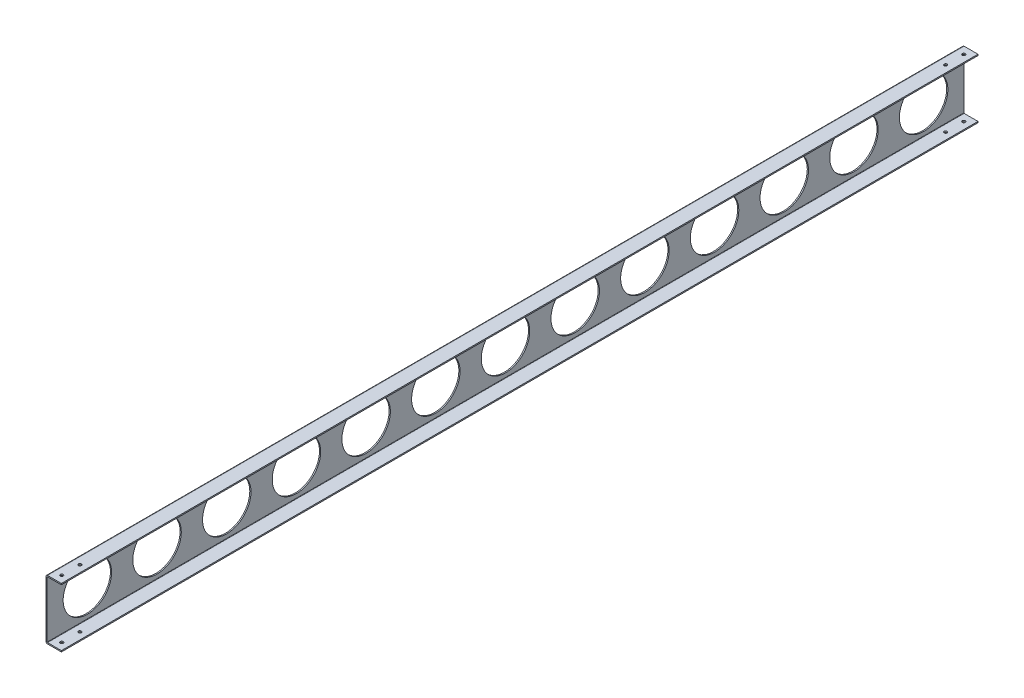
ISO-10303-21;
HEADER;
FILE_DESCRIPTION(('STEP AP214'),'2;1');
FILE_NAME('part.step','',(''),(''),'','','');
FILE_SCHEMA(('AUTOMOTIVE_DESIGN { 1 0 10303 214 1 1 1 1 }'));
ENDSEC;
DATA;
#1=APPLICATION_CONTEXT('core data for automotive mechanical design processes');
#2=APPLICATION_PROTOCOL_DEFINITION('international standard','automotive_design',2000,#1);
#3=PRODUCT_CONTEXT('',#1,'mechanical');
#4=PRODUCT('Part','Part','',(#3));
#5=PRODUCT_RELATED_PRODUCT_CATEGORY('part','',(#4));
#6=PRODUCT_DEFINITION_FORMATION('','',#4);
#7=PRODUCT_DEFINITION_CONTEXT('part definition',#1,'design');
#8=PRODUCT_DEFINITION('design','',#6,#7);
#9=PRODUCT_DEFINITION_SHAPE('','',#8);
#10=(LENGTH_UNIT() NAMED_UNIT(*) SI_UNIT(.MILLI.,.METRE.));
#11=(NAMED_UNIT(*) PLANE_ANGLE_UNIT() SI_UNIT($,.RADIAN.));
#12=(NAMED_UNIT(*) SI_UNIT($,.STERADIAN.) SOLID_ANGLE_UNIT());
#13=UNCERTAINTY_MEASURE_WITH_UNIT(LENGTH_MEASURE(1.E-05),#10,'distance_accuracy_value','');
#14=(GEOMETRIC_REPRESENTATION_CONTEXT(3) GLOBAL_UNCERTAINTY_ASSIGNED_CONTEXT((#13)) GLOBAL_UNIT_ASSIGNED_CONTEXT((#10,
#11,#12)) REPRESENTATION_CONTEXT('',''));
#15=CARTESIAN_POINT('',(0.,0.,0.));
#16=DIRECTION('',(0.,0.,1.));
#17=DIRECTION('',(1.,0.,0.));
#18=AXIS2_PLACEMENT_3D('',#15,#16,#17);
#19=CARTESIAN_POINT('',(2.54000000000001,-49.,756.30962295));
#20=DIRECTION('',(0.,1.,0.));
#21=DIRECTION('',(-1.,0.,0.));
#22=AXIS2_PLACEMENT_3D('',#19,#20,#21);
#23=PLANE('',#22);
#24=CARTESIAN_POINT('',(13.97,-49.,-744.30962295));
#25=DIRECTION('',(0.,-1.,0.));
#26=DIRECTION('',(0.,0.,-1.));
#27=AXIS2_PLACEMENT_3D('',#24,#25,#26);
#28=CIRCLE('',#27,2.48919999999999);
#29=CARTESIAN_POINT('',(13.97,-49.,-746.79882295));
#30=VERTEX_POINT('',#29);
#31=EDGE_CURVE('E466',#30,#30,#28,.T.);
#32=ORIENTED_EDGE('',*,*,#31,.F.);
#33=EDGE_LOOP('',(#32));
#34=FACE_BOUND('',#33,.T.);
#35=CARTESIAN_POINT('',(13.97,-49.,-714.30962295));
#36=DIRECTION('',(0.,-1.,0.));
#37=DIRECTION('',(0.,0.,-1.));
#38=AXIS2_PLACEMENT_3D('',#35,#36,#37);
#39=CIRCLE('',#38,2.48919999999999);
#40=CARTESIAN_POINT('',(13.97,-49.,-716.79882295));
#41=VERTEX_POINT('',#40);
#42=EDGE_CURVE('E456',#41,#41,#39,.T.);
#43=ORIENTED_EDGE('',*,*,#42,.F.);
#44=EDGE_LOOP('',(#43));
#45=FACE_BOUND('',#44,.T.);
#46=CARTESIAN_POINT('',(13.97,-49.,744.30962295));
#47=DIRECTION('',(0.,-1.,0.));
#48=DIRECTION('',(0.,0.,-1.));
#49=AXIS2_PLACEMENT_3D('',#46,#47,#48);
#50=CIRCLE('',#49,2.48919999999999);
#51=CARTESIAN_POINT('',(13.97,-49.,741.82042295));
#52=VERTEX_POINT('',#51);
#53=EDGE_CURVE('E446',#52,#52,#50,.T.);
#54=ORIENTED_EDGE('',*,*,#53,.F.);
#55=EDGE_LOOP('',(#54));
#56=FACE_BOUND('',#55,.T.);
#57=CARTESIAN_POINT('',(13.97,-49.,714.30962295));
#58=DIRECTION('',(0.,-1.,0.));
#59=DIRECTION('',(0.,0.,-1.));
#60=AXIS2_PLACEMENT_3D('',#57,#58,#59);
#61=CIRCLE('',#60,2.48919999999999);
#62=CARTESIAN_POINT('',(13.97,-49.,711.82042295));
#63=VERTEX_POINT('',#62);
#64=EDGE_CURVE('E436',#63,#63,#61,.T.);
#65=ORIENTED_EDGE('',*,*,#64,.F.);
#66=EDGE_LOOP('',(#65));
#67=FACE_BOUND('',#66,.T.);
#68=DIRECTION('',(1.,0.,0.));
#69=VECTOR('',#68,1.);
#70=CARTESIAN_POINT('',(2.54000000000001,-49.,-756.30962295));
#71=LINE('',#70,#69);
#72=CARTESIAN_POINT('',(2.54000000000001,-49.,-756.30962295));
#73=VERTEX_POINT('',#72);
#74=CARTESIAN_POINT('',(25.4,-49.,-756.30962295));
#75=VERTEX_POINT('',#74);
#76=EDGE_CURVE('E155',#73,#75,#71,.T.);
#77=ORIENTED_EDGE('',*,*,#76,.T.);
#78=DIRECTION('',(0.,0.,-1.));
#79=VECTOR('',#78,1.);
#80=CARTESIAN_POINT('',(25.4,-49.,756.30962295));
#81=LINE('',#80,#79);
#82=CARTESIAN_POINT('',(25.4,-49.,756.30962295));
#83=VERTEX_POINT('',#82);
#84=EDGE_CURVE('E202',#83,#75,#81,.T.);
#85=ORIENTED_EDGE('',*,*,#84,.F.);
#86=DIRECTION('',(1.,0.,0.));
#87=VECTOR('',#86,1.);
#88=CARTESIAN_POINT('',(2.54000000000001,-49.,756.30962295));
#89=LINE('',#88,#87);
#90=CARTESIAN_POINT('',(2.54000000000001,-49.,756.30962295));
#91=VERTEX_POINT('',#90);
#92=EDGE_CURVE('E102',#91,#83,#89,.T.);
#93=ORIENTED_EDGE('',*,*,#92,.F.);
#94=DIRECTION('',(0.,0.,-1.));
#95=VECTOR('',#94,1.);
#96=CARTESIAN_POINT('',(2.54000000000001,-49.,756.30962295));
#97=LINE('',#96,#95);
#98=EDGE_CURVE('E151',#91,#73,#97,.T.);
#99=ORIENTED_EDGE('',*,*,#98,.T.);
#100=EDGE_LOOP('',(#77,#85,#93,#99));
#101=FACE_BOUND('',#100,.T.);
#102=ADVANCED_FACE('F32',(#34,#45,#56,#67,#101),#23,.F.);
#103=CARTESIAN_POINT('',(25.4,-47.,756.30962295));
#104=DIRECTION('',(1.,0.,0.));
#105=DIRECTION('',(0.,0.,-1.));
#106=AXIS2_PLACEMENT_3D('',#103,#104,#105);
#107=PLANE('',#106);
#108=DIRECTION('',(0.,-1.,0.));
#109=VECTOR('',#108,1.);
#110=CARTESIAN_POINT('',(25.4,-47.,-756.30962295));
#111=LINE('',#110,#109);
#112=CARTESIAN_POINT('',(25.4,-47.,-756.30962295));
#113=VERTEX_POINT('',#112);
#114=EDGE_CURVE('E158',#113,#75,#111,.T.);
#115=ORIENTED_EDGE('',*,*,#114,.F.);
#116=DIRECTION('',(0.,0.,-1.));
#117=VECTOR('',#116,1.);
#118=CARTESIAN_POINT('',(25.4,-47.,756.30962295));
#119=LINE('',#118,#117);
#120=CARTESIAN_POINT('',(25.4,-47.,756.30962295));
#121=VERTEX_POINT('',#120);
#122=EDGE_CURVE('E200',#121,#113,#119,.T.);
#123=ORIENTED_EDGE('',*,*,#122,.F.);
#124=DIRECTION('',(0.,-1.,0.));
#125=VECTOR('',#124,1.);
#126=CARTESIAN_POINT('',(25.4,-47.,756.30962295));
#127=LINE('',#126,#125);
#128=EDGE_CURVE('E409',#121,#83,#127,.T.);
#129=ORIENTED_EDGE('',*,*,#128,.T.);
#130=ORIENTED_EDGE('',*,*,#84,.T.);
#131=EDGE_LOOP('',(#115,#123,#129,#130));
#132=FACE_BOUND('',#131,.T.);
#133=ADVANCED_FACE('F286',(#132),#107,.T.);
#134=CARTESIAN_POINT('',(2.54000000000001,-47.,756.30962295));
#135=DIRECTION('',(0.,1.,0.));
#136=DIRECTION('',(-1.,0.,0.));
#137=AXIS2_PLACEMENT_3D('',#134,#135,#136);
#138=PLANE('',#137);
#139=CARTESIAN_POINT('',(13.97,-47.,-744.30962295));
#140=DIRECTION('',(0.,1.,0.));
#141=DIRECTION('',(-1.,0.,0.));
#142=AXIS2_PLACEMENT_3D('',#139,#140,#141);
#143=CIRCLE('',#142,2.48919999999998);
#144=CARTESIAN_POINT('',(11.4808000000001,-47.,-744.30962295));
#145=VERTEX_POINT('',#144);
#146=EDGE_CURVE('E459',#145,#145,#143,.T.);
#147=ORIENTED_EDGE('',*,*,#146,.F.);
#148=EDGE_LOOP('',(#147));
#149=FACE_BOUND('',#148,.T.);
#150=CARTESIAN_POINT('',(13.97,-47.,-714.30962295));
#151=DIRECTION('',(0.,1.,0.));
#152=DIRECTION('',(-1.,0.,0.));
#153=AXIS2_PLACEMENT_3D('',#150,#151,#152);
#154=CIRCLE('',#153,2.48919999999998);
#155=CARTESIAN_POINT('',(11.4808,-47.,-714.30962295));
#156=VERTEX_POINT('',#155);
#157=EDGE_CURVE('E449',#156,#156,#154,.T.);
#158=ORIENTED_EDGE('',*,*,#157,.F.);
#159=EDGE_LOOP('',(#158));
#160=FACE_BOUND('',#159,.T.);
#161=CARTESIAN_POINT('',(13.97,-47.,744.30962295));
#162=DIRECTION('',(0.,1.,0.));
#163=DIRECTION('',(-1.,0.,0.));
#164=AXIS2_PLACEMENT_3D('',#161,#162,#163);
#165=CIRCLE('',#164,2.48919999999998);
#166=CARTESIAN_POINT('',(11.4808000000001,-47.,744.30962295));
#167=VERTEX_POINT('',#166);
#168=EDGE_CURVE('E439',#167,#167,#165,.T.);
#169=ORIENTED_EDGE('',*,*,#168,.F.);
#170=EDGE_LOOP('',(#169));
#171=FACE_BOUND('',#170,.T.);
#172=CARTESIAN_POINT('',(13.97,-47.,714.30962295));
#173=DIRECTION('',(0.,1.,0.));
#174=DIRECTION('',(-1.,0.,0.));
#175=AXIS2_PLACEMENT_3D('',#172,#173,#174);
#176=CIRCLE('',#175,2.48919999999998);
#177=CARTESIAN_POINT('',(11.4808,-47.,714.30962295));
#178=VERTEX_POINT('',#177);
#179=EDGE_CURVE('E430',#178,#178,#176,.T.);
#180=ORIENTED_EDGE('',*,*,#179,.F.);
#181=EDGE_LOOP('',(#180));
#182=FACE_BOUND('',#181,.T.);
#183=DIRECTION('',(1.,0.,0.));
#184=VECTOR('',#183,1.);
#185=CARTESIAN_POINT('',(2.54000000000001,-47.,-756.30962295));
#186=LINE('',#185,#184);
#187=CARTESIAN_POINT('',(2.54000000000001,-47.,-756.30962295));
#188=VERTEX_POINT('',#187);
#189=EDGE_CURVE('E162',#188,#113,#186,.T.);
#190=ORIENTED_EDGE('',*,*,#189,.F.);
#191=DIRECTION('',(0.,0.,-1.));
#192=VECTOR('',#191,1.);
#193=CARTESIAN_POINT('',(2.54000000000001,-47.,756.30962295));
#194=LINE('',#193,#192);
#195=CARTESIAN_POINT('',(2.54000000000001,-47.,756.30962295));
#196=VERTEX_POINT('',#195);
#197=EDGE_CURVE('E198',#196,#188,#194,.T.);
#198=ORIENTED_EDGE('',*,*,#197,.F.);
#199=DIRECTION('',(1.,0.,0.));
#200=VECTOR('',#199,1.);
#201=CARTESIAN_POINT('',(2.54000000000001,-47.,756.30962295));
#202=LINE('',#201,#200);
#203=EDGE_CURVE('E406',#196,#121,#202,.T.);
#204=ORIENTED_EDGE('',*,*,#203,.T.);
#205=ORIENTED_EDGE('',*,*,#122,.T.);
#206=EDGE_LOOP('',(#190,#198,#204,#205));
#207=FACE_BOUND('',#206,.T.);
#208=ADVANCED_FACE('F280',(#149,#160,#171,#182,#207),#138,.T.);
#209=CARTESIAN_POINT('',(2.54000000000001,-46.46,756.30962295));
#210=DIRECTION('',(0.,0.,-1.));
#211=DIRECTION('',(-1.,0.,0.));
#212=AXIS2_PLACEMENT_3D('',#209,#210,#211);
#213=CYLINDRICAL_SURFACE('',#212,0.540000000000001);
#214=CARTESIAN_POINT('',(2.54000000000001,-46.46,-756.30962295));
#215=DIRECTION('',(0.,0.,1.));
#216=DIRECTION('',(1.,0.,0.));
#217=AXIS2_PLACEMENT_3D('',#214,#215,#216);
#218=CIRCLE('',#217,0.540000000000001);
#219=CARTESIAN_POINT('',(2.00000000000001,-46.46,-756.30962295));
#220=VERTEX_POINT('',#219);
#221=EDGE_CURVE('E165',#220,#188,#218,.T.);
#222=ORIENTED_EDGE('',*,*,#221,.F.);
#223=DIRECTION('',(0.,0.,-1.));
#224=VECTOR('',#223,1.);
#225=CARTESIAN_POINT('',(2.00000000000001,-46.46,756.30962295));
#226=LINE('',#225,#224);
#227=CARTESIAN_POINT('',(2.00000000000001,-46.46,756.30962295));
#228=VERTEX_POINT('',#227);
#229=EDGE_CURVE('E196',#228,#220,#226,.T.);
#230=ORIENTED_EDGE('',*,*,#229,.F.);
#231=CARTESIAN_POINT('',(2.54000000000001,-46.46,756.30962295));
#232=DIRECTION('',(0.,0.,1.));
#233=DIRECTION('',(1.,0.,0.));
#234=AXIS2_PLACEMENT_3D('',#231,#232,#233);
#235=CIRCLE('',#234,0.540000000000001);
#236=EDGE_CURVE('E403',#228,#196,#235,.T.);
#237=ORIENTED_EDGE('',*,*,#236,.T.);
#238=ORIENTED_EDGE('',*,*,#197,.T.);
#239=EDGE_LOOP('',(#222,#230,#237,#238));
#240=FACE_BOUND('',#239,.T.);
#241=ADVANCED_FACE('F270',(#240),#213,.F.);
#242=CARTESIAN_POINT('',(2.00000000000001,46.46,756.30962295));
#243=DIRECTION('',(1.,0.,0.));
#244=DIRECTION('',(0.,0.,-1.));
#245=AXIS2_PLACEMENT_3D('',#242,#243,#244);
#246=PLANE('',#245);
#247=CARTESIAN_POINT('',(2.00000000000001,0.,-115.));
#248=DIRECTION('',(1.,0.,0.));
#249=DIRECTION('',(0.,0.,-1.));
#250=AXIS2_PLACEMENT_3D('',#247,#248,#249);
#251=CIRCLE('',#250,40.);
#252=CARTESIAN_POINT('',(2.00000000000001,0.,-155.));
#253=VERTEX_POINT('',#252);
#254=EDGE_CURVE('E424',#253,#253,#251,.T.);
#255=ORIENTED_EDGE('',*,*,#254,.F.);
#256=EDGE_LOOP('',(#255));
#257=FACE_BOUND('',#256,.T.);
#258=CARTESIAN_POINT('',(2.00000000000001,0.,115.));
#259=DIRECTION('',(1.,0.,0.));
#260=DIRECTION('',(0.,0.,-1.));
#261=AXIS2_PLACEMENT_3D('',#258,#259,#260);
#262=CIRCLE('',#261,40.);
#263=CARTESIAN_POINT('',(2.00000000000001,0.,75.));
#264=VERTEX_POINT('',#263);
#265=EDGE_CURVE('E416',#264,#264,#262,.T.);
#266=ORIENTED_EDGE('',*,*,#265,.F.);
#267=EDGE_LOOP('',(#266));
#268=FACE_BOUND('',#267,.T.);
#269=CARTESIAN_POINT('',(2.00000000000001,0.,0.));
#270=DIRECTION('',(1.,0.,0.));
#271=DIRECTION('',(0.,0.,-1.));
#272=AXIS2_PLACEMENT_3D('',#269,#270,#271);
#273=CIRCLE('',#272,40.);
#274=CARTESIAN_POINT('',(2.00000000000001,0.,-40.));
#275=VERTEX_POINT('',#274);
#276=EDGE_CURVE('E413',#275,#275,#273,.T.);
#277=ORIENTED_EDGE('',*,*,#276,.F.);
#278=EDGE_LOOP('',(#277));
#279=FACE_BOUND('',#278,.T.);
#280=DIRECTION('',(0.,1.,0.));
#281=VECTOR('',#280,1.);
#282=CARTESIAN_POINT('',(2.00000000000001,46.46,-756.30962295));
#283=LINE('',#282,#281);
#284=CARTESIAN_POINT('',(2.00000000000001,46.46,-756.30962295));
#285=VERTEX_POINT('',#284);
#286=EDGE_CURVE('E168',#285,#220,#283,.F.);
#287=ORIENTED_EDGE('',*,*,#286,.F.);
#288=DIRECTION('',(0.,0.,-1.));
#289=VECTOR('',#288,1.);
#290=CARTESIAN_POINT('',(2.00000000000001,46.46,756.30962295));
#291=LINE('',#290,#289);
#292=CARTESIAN_POINT('',(2.00000000000001,46.46,756.30962295));
#293=VERTEX_POINT('',#292);
#294=EDGE_CURVE('E194',#293,#285,#291,.T.);
#295=ORIENTED_EDGE('',*,*,#294,.F.);
#296=DIRECTION('',(0.,1.,0.));
#297=VECTOR('',#296,1.);
#298=CARTESIAN_POINT('',(2.00000000000001,46.46,756.30962295));
#299=LINE('',#298,#297);
#300=EDGE_CURVE('E400',#293,#228,#299,.F.);
#301=ORIENTED_EDGE('',*,*,#300,.T.);
#302=ORIENTED_EDGE('',*,*,#229,.T.);
#303=EDGE_LOOP('',(#287,#295,#301,#302));
#304=FACE_BOUND('',#303,.T.);
#305=CARTESIAN_POINT('',(2.00000000000001,0.,230.));
#306=DIRECTION('',(1.,0.,0.));
#307=DIRECTION('',(0.,0.,-1.));
#308=AXIS2_PLACEMENT_3D('',#305,#306,#307);
#309=CIRCLE('',#308,40.);
#310=CARTESIAN_POINT('',(2.00000000000001,0.,190.));
#311=VERTEX_POINT('',#310);
#312=EDGE_CURVE('E207',#311,#311,#309,.T.);
#313=ORIENTED_EDGE('',*,*,#312,.F.);
#314=EDGE_LOOP('',(#313));
#315=FACE_BOUND('',#314,.T.);
#316=CARTESIAN_POINT('',(2.00000000000001,0.,345.));
#317=DIRECTION('',(1.,0.,0.));
#318=DIRECTION('',(0.,0.,-1.));
#319=AXIS2_PLACEMENT_3D('',#316,#317,#318);
#320=CIRCLE('',#319,40.);
#321=CARTESIAN_POINT('',(2.00000000000001,0.,305.));
#322=VERTEX_POINT('',#321);
#323=EDGE_CURVE('E213',#322,#322,#320,.T.);
#324=ORIENTED_EDGE('',*,*,#323,.F.);
#325=EDGE_LOOP('',(#324));
#326=FACE_BOUND('',#325,.T.);
#327=CARTESIAN_POINT('',(2.00000000000001,0.,460.));
#328=DIRECTION('',(1.,0.,0.));
#329=DIRECTION('',(0.,0.,-1.));
#330=AXIS2_PLACEMENT_3D('',#327,#328,#329);
#331=CIRCLE('',#330,40.);
#332=CARTESIAN_POINT('',(2.00000000000001,0.,420.));
#333=VERTEX_POINT('',#332);
#334=EDGE_CURVE('E219',#333,#333,#331,.T.);
#335=ORIENTED_EDGE('',*,*,#334,.F.);
#336=EDGE_LOOP('',(#335));
#337=FACE_BOUND('',#336,.T.);
#338=CARTESIAN_POINT('',(2.00000000000001,0.,575.));
#339=DIRECTION('',(1.,0.,0.));
#340=DIRECTION('',(0.,0.,-1.));
#341=AXIS2_PLACEMENT_3D('',#338,#339,#340);
#342=CIRCLE('',#341,40.);
#343=CARTESIAN_POINT('',(2.00000000000001,0.,535.));
#344=VERTEX_POINT('',#343);
#345=EDGE_CURVE('E225',#344,#344,#342,.T.);
#346=ORIENTED_EDGE('',*,*,#345,.F.);
#347=EDGE_LOOP('',(#346));
#348=FACE_BOUND('',#347,.T.);
#349=CARTESIAN_POINT('',(2.00000000000001,0.,690.));
#350=DIRECTION('',(1.,0.,0.));
#351=DIRECTION('',(0.,0.,-1.));
#352=AXIS2_PLACEMENT_3D('',#349,#350,#351);
#353=CIRCLE('',#352,40.);
#354=CARTESIAN_POINT('',(2.00000000000001,0.,650.));
#355=VERTEX_POINT('',#354);
#356=EDGE_CURVE('E231',#355,#355,#353,.T.);
#357=ORIENTED_EDGE('',*,*,#356,.F.);
#358=EDGE_LOOP('',(#357));
#359=FACE_BOUND('',#358,.T.);
#360=CARTESIAN_POINT('',(2.00000000000001,0.,-230.));
#361=DIRECTION('',(1.,0.,0.));
#362=DIRECTION('',(0.,0.,-1.));
#363=AXIS2_PLACEMENT_3D('',#360,#361,#362);
#364=CIRCLE('',#363,40.);
#365=CARTESIAN_POINT('',(2.00000000000001,0.,-270.));
#366=VERTEX_POINT('',#365);
#367=EDGE_CURVE('E237',#366,#366,#364,.T.);
#368=ORIENTED_EDGE('',*,*,#367,.F.);
#369=EDGE_LOOP('',(#368));
#370=FACE_BOUND('',#369,.T.);
#371=CARTESIAN_POINT('',(2.00000000000001,0.,-345.));
#372=DIRECTION('',(1.,0.,0.));
#373=DIRECTION('',(0.,0.,-1.));
#374=AXIS2_PLACEMENT_3D('',#371,#372,#373);
#375=CIRCLE('',#374,40.);
#376=CARTESIAN_POINT('',(2.00000000000001,0.,-385.));
#377=VERTEX_POINT('',#376);
#378=EDGE_CURVE('E243',#377,#377,#375,.T.);
#379=ORIENTED_EDGE('',*,*,#378,.F.);
#380=EDGE_LOOP('',(#379));
#381=FACE_BOUND('',#380,.T.);
#382=CARTESIAN_POINT('',(2.00000000000001,0.,-460.));
#383=DIRECTION('',(1.,0.,0.));
#384=DIRECTION('',(0.,0.,-1.));
#385=AXIS2_PLACEMENT_3D('',#382,#383,#384);
#386=CIRCLE('',#385,40.);
#387=CARTESIAN_POINT('',(2.00000000000001,0.,-500.));
#388=VERTEX_POINT('',#387);
#389=EDGE_CURVE('E249',#388,#388,#386,.T.);
#390=ORIENTED_EDGE('',*,*,#389,.F.);
#391=EDGE_LOOP('',(#390));
#392=FACE_BOUND('',#391,.T.);
#393=CARTESIAN_POINT('',(2.00000000000001,0.,-575.));
#394=DIRECTION('',(1.,0.,0.));
#395=DIRECTION('',(0.,0.,-1.));
#396=AXIS2_PLACEMENT_3D('',#393,#394,#395);
#397=CIRCLE('',#396,40.);
#398=CARTESIAN_POINT('',(2.00000000000001,0.,-615.));
#399=VERTEX_POINT('',#398);
#400=EDGE_CURVE('E255',#399,#399,#397,.T.);
#401=ORIENTED_EDGE('',*,*,#400,.F.);
#402=EDGE_LOOP('',(#401));
#403=FACE_BOUND('',#402,.T.);
#404=CARTESIAN_POINT('',(2.00000000000001,0.,-690.));
#405=DIRECTION('',(1.,0.,0.));
#406=DIRECTION('',(0.,0.,-1.));
#407=AXIS2_PLACEMENT_3D('',#404,#405,#406);
#408=CIRCLE('',#407,40.);
#409=CARTESIAN_POINT('',(2.00000000000001,0.,-730.));
#410=VERTEX_POINT('',#409);
#411=EDGE_CURVE('E11',#410,#410,#408,.T.);
#412=ORIENTED_EDGE('',*,*,#411,.F.);
#413=EDGE_LOOP('',(#412));
#414=FACE_BOUND('',#413,.T.);
#415=ADVANCED_FACE('F267',(#257,#268,#279,#304,#315,#326,#337,#348,#359,#370,#381,#392,#403,
#414),#246,.T.);
#416=CARTESIAN_POINT('',(2.54000000000001,46.46,756.30962295));
#417=DIRECTION('',(0.,0.,-1.));
#418=DIRECTION('',(-1.,0.,0.));
#419=AXIS2_PLACEMENT_3D('',#416,#417,#418);
#420=CYLINDRICAL_SURFACE('',#419,0.540000000000001);
#421=CARTESIAN_POINT('',(2.54000000000001,46.46,-756.30962295));
#422=DIRECTION('',(0.,0.,1.));
#423=DIRECTION('',(1.,0.,0.));
#424=AXIS2_PLACEMENT_3D('',#421,#422,#423);
#425=CIRCLE('',#424,0.540000000000001);
#426=CARTESIAN_POINT('',(2.54000000000001,47.,-756.30962295));
#427=VERTEX_POINT('',#426);
#428=EDGE_CURVE('E171',#427,#285,#425,.T.);
#429=ORIENTED_EDGE('',*,*,#428,.F.);
#430=DIRECTION('',(0.,0.,-1.));
#431=VECTOR('',#430,1.);
#432=CARTESIAN_POINT('',(2.54000000000001,47.,756.30962295));
#433=LINE('',#432,#431);
#434=CARTESIAN_POINT('',(2.54000000000001,47.,756.30962295));
#435=VERTEX_POINT('',#434);
#436=EDGE_CURVE('E192',#435,#427,#433,.T.);
#437=ORIENTED_EDGE('',*,*,#436,.F.);
#438=CARTESIAN_POINT('',(2.54000000000001,46.46,756.30962295));
#439=DIRECTION('',(0.,0.,1.));
#440=DIRECTION('',(1.,0.,0.));
#441=AXIS2_PLACEMENT_3D('',#438,#439,#440);
#442=CIRCLE('',#441,0.540000000000001);
#443=EDGE_CURVE('E395',#435,#293,#442,.T.);
#444=ORIENTED_EDGE('',*,*,#443,.T.);
#445=ORIENTED_EDGE('',*,*,#294,.T.);
#446=EDGE_LOOP('',(#429,#437,#444,#445));
#447=FACE_BOUND('',#446,.T.);
#448=ADVANCED_FACE('F269',(#447),#420,.F.);
#449=CARTESIAN_POINT('',(2.54000000000001,47.,756.30962295));
#450=DIRECTION('',(0.,-1.,0.));
#451=DIRECTION('',(1.,0.,0.));
#452=AXIS2_PLACEMENT_3D('',#449,#450,#451);
#453=PLANE('',#452);
#454=CARTESIAN_POINT('',(13.97,47.,-744.30962295));
#455=DIRECTION('',(0.,-1.,0.));
#456=DIRECTION('',(1.,0.,0.));
#457=AXIS2_PLACEMENT_3D('',#454,#455,#456);
#458=CIRCLE('',#457,2.48919999999998);
#459=CARTESIAN_POINT('',(16.4592,47.,-744.30962295));
#460=VERTEX_POINT('',#459);
#461=EDGE_CURVE('E369',#460,#460,#458,.T.);
#462=ORIENTED_EDGE('',*,*,#461,.F.);
#463=EDGE_LOOP('',(#462));
#464=FACE_BOUND('',#463,.T.);
#465=CARTESIAN_POINT('',(13.97,47.,-714.30962295));
#466=DIRECTION('',(0.,-1.,0.));
#467=DIRECTION('',(1.,0.,0.));
#468=AXIS2_PLACEMENT_3D('',#465,#466,#467);
#469=CIRCLE('',#468,2.48919999999998);
#470=CARTESIAN_POINT('',(16.4592,47.,-714.30962295));
#471=VERTEX_POINT('',#470);
#472=EDGE_CURVE('E373',#471,#471,#469,.T.);
#473=ORIENTED_EDGE('',*,*,#472,.F.);
#474=EDGE_LOOP('',(#473));
#475=FACE_BOUND('',#474,.T.);
#476=CARTESIAN_POINT('',(13.97,47.,744.30962295));
#477=DIRECTION('',(0.,-1.,0.));
#478=DIRECTION('',(1.,0.,0.));
#479=AXIS2_PLACEMENT_3D('',#476,#477,#478);
#480=CIRCLE('',#479,2.48919999999998);
#481=CARTESIAN_POINT('',(16.4592,47.,744.30962295));
#482=VERTEX_POINT('',#481);
#483=EDGE_CURVE('E377',#482,#482,#480,.T.);
#484=ORIENTED_EDGE('',*,*,#483,.F.);
#485=EDGE_LOOP('',(#484));
#486=FACE_BOUND('',#485,.T.);
#487=CARTESIAN_POINT('',(13.97,47.,714.30962295));
#488=DIRECTION('',(0.,-1.,0.));
#489=DIRECTION('',(1.,0.,0.));
#490=AXIS2_PLACEMENT_3D('',#487,#488,#489);
#491=CIRCLE('',#490,2.48919999999998);
#492=CARTESIAN_POINT('',(16.4592,47.,714.30962295));
#493=VERTEX_POINT('',#492);
#494=EDGE_CURVE('E381',#493,#493,#491,.T.);
#495=ORIENTED_EDGE('',*,*,#494,.F.);
#496=EDGE_LOOP('',(#495));
#497=FACE_BOUND('',#496,.T.);
#498=DIRECTION('',(-1.,0.,0.));
#499=VECTOR('',#498,1.);
#500=CARTESIAN_POINT('',(2.54000000000001,47.,-756.30962295));
#501=LINE('',#500,#499);
#502=CARTESIAN_POINT('',(25.4,47.,-756.30962295));
#503=VERTEX_POINT('',#502);
#504=EDGE_CURVE('E174',#503,#427,#501,.T.);
#505=ORIENTED_EDGE('',*,*,#504,.F.);
#506=DIRECTION('',(0.,0.,-1.));
#507=VECTOR('',#506,1.);
#508=CARTESIAN_POINT('',(25.4,47.,756.30962295));
#509=LINE('',#508,#507);
#510=CARTESIAN_POINT('',(25.4,47.,756.30962295));
#511=VERTEX_POINT('',#510);
#512=EDGE_CURVE('E190',#511,#503,#509,.T.);
#513=ORIENTED_EDGE('',*,*,#512,.F.);
#514=DIRECTION('',(-1.,0.,0.));
#515=VECTOR('',#514,1.);
#516=CARTESIAN_POINT('',(2.54000000000001,47.,756.30962295));
#517=LINE('',#516,#515);
#518=EDGE_CURVE('E393',#511,#435,#517,.T.);
#519=ORIENTED_EDGE('',*,*,#518,.T.);
#520=ORIENTED_EDGE('',*,*,#436,.T.);
#521=EDGE_LOOP('',(#505,#513,#519,#520));
#522=FACE_BOUND('',#521,.T.);
#523=ADVANCED_FACE('F277',(#464,#475,#486,#497,#522),#453,.T.);
#524=CARTESIAN_POINT('',(25.4,49.,756.30962295));
#525=DIRECTION('',(1.,0.,0.));
#526=DIRECTION('',(0.,0.,-1.));
#527=AXIS2_PLACEMENT_3D('',#524,#525,#526);
#528=PLANE('',#527);
#529=DIRECTION('',(0.,-1.,0.));
#530=VECTOR('',#529,1.);
#531=CARTESIAN_POINT('',(25.4,49.,-756.30962295));
#532=LINE('',#531,#530);
#533=CARTESIAN_POINT('',(25.4,49.,-756.30962295));
#534=VERTEX_POINT('',#533);
#535=EDGE_CURVE('E177',#534,#503,#532,.T.);
#536=ORIENTED_EDGE('',*,*,#535,.F.);
#537=DIRECTION('',(0.,0.,-1.));
#538=VECTOR('',#537,1.);
#539=CARTESIAN_POINT('',(25.4,49.,756.30962295));
#540=LINE('',#539,#538);
#541=CARTESIAN_POINT('',(25.4,49.,756.30962295));
#542=VERTEX_POINT('',#541);
#543=EDGE_CURVE('E188',#542,#534,#540,.T.);
#544=ORIENTED_EDGE('',*,*,#543,.F.);
#545=DIRECTION('',(0.,-1.,0.));
#546=VECTOR('',#545,1.);
#547=CARTESIAN_POINT('',(25.4,49.,756.30962295));
#548=LINE('',#547,#546);
#549=EDGE_CURVE('E392',#542,#511,#548,.T.);
#550=ORIENTED_EDGE('',*,*,#549,.T.);
#551=ORIENTED_EDGE('',*,*,#512,.T.);
#552=EDGE_LOOP('',(#536,#544,#550,#551));
#553=FACE_BOUND('',#552,.T.);
#554=ADVANCED_FACE('F357',(#553),#528,.T.);
#555=CARTESIAN_POINT('',(2.54000000000001,49.,756.30962295));
#556=DIRECTION('',(0.,-1.,0.));
#557=DIRECTION('',(1.,0.,0.));
#558=AXIS2_PLACEMENT_3D('',#555,#556,#557);
#559=PLANE('',#558);
#560=CARTESIAN_POINT('',(13.97,49.,-744.30962295));
#561=DIRECTION('',(0.,-1.,0.));
#562=DIRECTION('',(0.,0.,-1.));
#563=AXIS2_PLACEMENT_3D('',#560,#561,#562);
#564=CIRCLE('',#563,2.48919999999998);
#565=CARTESIAN_POINT('',(13.97,49.,-746.79882295));
#566=VERTEX_POINT('',#565);
#567=EDGE_CURVE('E463',#566,#566,#564,.T.);
#568=ORIENTED_EDGE('',*,*,#567,.T.);
#569=EDGE_LOOP('',(#568));
#570=FACE_BOUND('',#569,.T.);
#571=CARTESIAN_POINT('',(13.97,49.,-714.30962295));
#572=DIRECTION('',(0.,-1.,0.));
#573=DIRECTION('',(0.,0.,-1.));
#574=AXIS2_PLACEMENT_3D('',#571,#572,#573);
#575=CIRCLE('',#574,2.48919999999998);
#576=CARTESIAN_POINT('',(13.97,49.,-716.79882295));
#577=VERTEX_POINT('',#576);
#578=EDGE_CURVE('E453',#577,#577,#575,.T.);
#579=ORIENTED_EDGE('',*,*,#578,.T.);
#580=EDGE_LOOP('',(#579));
#581=FACE_BOUND('',#580,.T.);
#582=CARTESIAN_POINT('',(13.97,49.,744.30962295));
#583=DIRECTION('',(0.,-1.,0.));
#584=DIRECTION('',(0.,0.,-1.));
#585=AXIS2_PLACEMENT_3D('',#582,#583,#584);
#586=CIRCLE('',#585,2.48919999999998);
#587=CARTESIAN_POINT('',(13.97,49.,741.82042295));
#588=VERTEX_POINT('',#587);
#589=EDGE_CURVE('E443',#588,#588,#586,.T.);
#590=ORIENTED_EDGE('',*,*,#589,.T.);
#591=EDGE_LOOP('',(#590));
#592=FACE_BOUND('',#591,.T.);
#593=CARTESIAN_POINT('',(13.97,49.,714.30962295));
#594=DIRECTION('',(0.,-1.,0.));
#595=DIRECTION('',(0.,0.,-1.));
#596=AXIS2_PLACEMENT_3D('',#593,#594,#595);
#597=CIRCLE('',#596,2.48919999999998);
#598=CARTESIAN_POINT('',(13.97,49.,711.82042295));
#599=VERTEX_POINT('',#598);
#600=EDGE_CURVE('E433',#599,#599,#597,.T.);
#601=ORIENTED_EDGE('',*,*,#600,.T.);
#602=EDGE_LOOP('',(#601));
#603=FACE_BOUND('',#602,.T.);
#604=DIRECTION('',(-1.,0.,0.));
#605=VECTOR('',#604,1.);
#606=CARTESIAN_POINT('',(2.54000000000001,49.,-756.30962295));
#607=LINE('',#606,#605);
#608=CARTESIAN_POINT('',(2.54000000000001,49.,-756.30962295));
#609=VERTEX_POINT('',#608);
#610=EDGE_CURVE('E180',#534,#609,#607,.T.);
#611=ORIENTED_EDGE('',*,*,#610,.T.);
#612=DIRECTION('',(0.,0.,-1.));
#613=VECTOR('',#612,1.);
#614=CARTESIAN_POINT('',(2.54000000000001,49.,756.30962295));
#615=LINE('',#614,#613);
#616=CARTESIAN_POINT('',(2.54000000000001,49.,756.30962295));
#617=VERTEX_POINT('',#616);
#618=EDGE_CURVE('E145',#617,#609,#615,.T.);
#619=ORIENTED_EDGE('',*,*,#618,.F.);
#620=DIRECTION('',(-1.,0.,0.));
#621=VECTOR('',#620,1.);
#622=CARTESIAN_POINT('',(2.54000000000001,49.,756.30962295));
#623=LINE('',#622,#621);
#624=EDGE_CURVE('E136',#542,#617,#623,.T.);
#625=ORIENTED_EDGE('',*,*,#624,.F.);
#626=ORIENTED_EDGE('',*,*,#543,.T.);
#627=EDGE_LOOP('',(#611,#619,#625,#626));
#628=FACE_BOUND('',#627,.T.);
#629=ADVANCED_FACE('F349',(#570,#581,#592,#603,#628),#559,.F.);
#630=CARTESIAN_POINT('',(2.54000000000001,46.46,756.30962295));
#631=DIRECTION('',(0.,0.,-1.));
#632=DIRECTION('',(-1.,0.,0.));
#633=AXIS2_PLACEMENT_3D('',#630,#631,#632);
#634=CYLINDRICAL_SURFACE('',#633,2.54);
#635=CARTESIAN_POINT('',(2.54000000000001,46.46,-756.30962295));
#636=DIRECTION('',(0.,0.,1.));
#637=DIRECTION('',(-1.,0.,0.));
#638=AXIS2_PLACEMENT_3D('',#635,#636,#637);
#639=CIRCLE('',#638,2.54);
#640=CARTESIAN_POINT('',(0.,46.46,-756.30962295));
#641=VERTEX_POINT('',#640);
#642=EDGE_CURVE('E144',#609,#641,#639,.T.);
#643=ORIENTED_EDGE('',*,*,#642,.T.);
#644=DIRECTION('',(0.,0.,-1.));
#645=VECTOR('',#644,1.);
#646=CARTESIAN_POINT('',(0.,46.46,756.30962295));
#647=LINE('',#646,#645);
#648=CARTESIAN_POINT('',(0.,46.46,756.30962295));
#649=VERTEX_POINT('',#648);
#650=EDGE_CURVE('E141',#649,#641,#647,.T.);
#651=ORIENTED_EDGE('',*,*,#650,.F.);
#652=CARTESIAN_POINT('',(2.54000000000001,46.46,756.30962295));
#653=DIRECTION('',(0.,0.,1.));
#654=DIRECTION('',(-1.,0.,0.));
#655=AXIS2_PLACEMENT_3D('',#652,#653,#654);
#656=CIRCLE('',#655,2.54);
#657=EDGE_CURVE('E129',#617,#649,#656,.T.);
#658=ORIENTED_EDGE('',*,*,#657,.F.);
#659=ORIENTED_EDGE('',*,*,#618,.T.);
#660=EDGE_LOOP('',(#643,#651,#658,#659));
#661=FACE_BOUND('',#660,.T.);
#662=ADVANCED_FACE('F142',(#661),#634,.T.);
#663=CARTESIAN_POINT('',(0.,46.46,756.30962295));
#664=DIRECTION('',(1.,0.,0.));
#665=DIRECTION('',(0.,0.,-1.));
#666=AXIS2_PLACEMENT_3D('',#663,#664,#665);
#667=PLANE('',#666);
#668=CARTESIAN_POINT('',(0.,0.,-115.));
#669=DIRECTION('',(1.,0.,0.));
#670=DIRECTION('',(0.,0.,-1.));
#671=AXIS2_PLACEMENT_3D('',#668,#669,#670);
#672=CIRCLE('',#671,40.);
#673=CARTESIAN_POINT('',(0.,0.,-155.));
#674=VERTEX_POINT('',#673);
#675=EDGE_CURVE('E427',#674,#674,#672,.T.);
#676=ORIENTED_EDGE('',*,*,#675,.T.);
#677=EDGE_LOOP('',(#676));
#678=FACE_BOUND('',#677,.T.);
#679=CARTESIAN_POINT('',(0.,0.,115.));
#680=DIRECTION('',(1.,0.,0.));
#681=DIRECTION('',(0.,0.,-1.));
#682=AXIS2_PLACEMENT_3D('',#679,#680,#681);
#683=CIRCLE('',#682,40.);
#684=CARTESIAN_POINT('',(0.,0.,75.));
#685=VERTEX_POINT('',#684);
#686=EDGE_CURVE('E421',#685,#685,#683,.T.);
#687=ORIENTED_EDGE('',*,*,#686,.T.);
#688=EDGE_LOOP('',(#687));
#689=FACE_BOUND('',#688,.T.);
#690=CARTESIAN_POINT('',(0.,0.,0.));
#691=DIRECTION('',(1.,0.,0.));
#692=DIRECTION('',(0.,0.,-1.));
#693=AXIS2_PLACEMENT_3D('',#690,#691,#692);
#694=CIRCLE('',#693,40.);
#695=CARTESIAN_POINT('',(0.,0.,-40.));
#696=VERTEX_POINT('',#695);
#697=EDGE_CURVE('E159',#696,#696,#694,.T.);
#698=ORIENTED_EDGE('',*,*,#697,.T.);
#699=EDGE_LOOP('',(#698));
#700=FACE_BOUND('',#699,.T.);
#701=DIRECTION('',(0.,-1.,0.));
#702=VECTOR('',#701,1.);
#703=CARTESIAN_POINT('',(0.,46.46,-756.30962295));
#704=LINE('',#703,#702);
#705=CARTESIAN_POINT('',(0.,-46.46,-756.30962295));
#706=VERTEX_POINT('',#705);
#707=EDGE_CURVE('E90',#641,#706,#704,.T.);
#708=ORIENTED_EDGE('',*,*,#707,.T.);
#709=DIRECTION('',(0.,0.,-1.));
#710=VECTOR('',#709,1.);
#711=CARTESIAN_POINT('',(0.,-46.46,756.30962295));
#712=LINE('',#711,#710);
#713=CARTESIAN_POINT('',(0.,-46.46,756.30962295));
#714=VERTEX_POINT('',#713);
#715=EDGE_CURVE('E146',#714,#706,#712,.T.);
#716=ORIENTED_EDGE('',*,*,#715,.F.);
#717=DIRECTION('',(0.,-1.,0.));
#718=VECTOR('',#717,1.);
#719=CARTESIAN_POINT('',(0.,46.46,756.30962295));
#720=LINE('',#719,#718);
#721=EDGE_CURVE('E133',#649,#714,#720,.T.);
#722=ORIENTED_EDGE('',*,*,#721,.F.);
#723=ORIENTED_EDGE('',*,*,#650,.T.);
#724=EDGE_LOOP('',(#708,#716,#722,#723));
#725=FACE_BOUND('',#724,.T.);
#726=CARTESIAN_POINT('',(0.,0.,230.));
#727=DIRECTION('',(1.,0.,0.));
#728=DIRECTION('',(0.,0.,-1.));
#729=AXIS2_PLACEMENT_3D('',#726,#727,#728);
#730=CIRCLE('',#729,40.);
#731=CARTESIAN_POINT('',(0.,0.,190.));
#732=VERTEX_POINT('',#731);
#733=EDGE_CURVE('E204',#732,#732,#730,.T.);
#734=ORIENTED_EDGE('',*,*,#733,.T.);
#735=EDGE_LOOP('',(#734));
#736=FACE_BOUND('',#735,.T.);
#737=CARTESIAN_POINT('',(0.,0.,345.));
#738=DIRECTION('',(1.,0.,0.));
#739=DIRECTION('',(0.,0.,-1.));
#740=AXIS2_PLACEMENT_3D('',#737,#738,#739);
#741=CIRCLE('',#740,40.);
#742=CARTESIAN_POINT('',(0.,0.,305.));
#743=VERTEX_POINT('',#742);
#744=EDGE_CURVE('E210',#743,#743,#741,.T.);
#745=ORIENTED_EDGE('',*,*,#744,.T.);
#746=EDGE_LOOP('',(#745));
#747=FACE_BOUND('',#746,.T.);
#748=CARTESIAN_POINT('',(0.,0.,460.));
#749=DIRECTION('',(1.,0.,0.));
#750=DIRECTION('',(0.,0.,-1.));
#751=AXIS2_PLACEMENT_3D('',#748,#749,#750);
#752=CIRCLE('',#751,40.);
#753=CARTESIAN_POINT('',(0.,0.,420.));
#754=VERTEX_POINT('',#753);
#755=EDGE_CURVE('E216',#754,#754,#752,.T.);
#756=ORIENTED_EDGE('',*,*,#755,.T.);
#757=EDGE_LOOP('',(#756));
#758=FACE_BOUND('',#757,.T.);
#759=CARTESIAN_POINT('',(0.,0.,575.));
#760=DIRECTION('',(1.,0.,0.));
#761=DIRECTION('',(0.,0.,-1.));
#762=AXIS2_PLACEMENT_3D('',#759,#760,#761);
#763=CIRCLE('',#762,40.);
#764=CARTESIAN_POINT('',(0.,0.,535.));
#765=VERTEX_POINT('',#764);
#766=EDGE_CURVE('E222',#765,#765,#763,.T.);
#767=ORIENTED_EDGE('',*,*,#766,.T.);
#768=EDGE_LOOP('',(#767));
#769=FACE_BOUND('',#768,.T.);
#770=CARTESIAN_POINT('',(0.,0.,690.));
#771=DIRECTION('',(1.,0.,0.));
#772=DIRECTION('',(0.,0.,-1.));
#773=AXIS2_PLACEMENT_3D('',#770,#771,#772);
#774=CIRCLE('',#773,40.);
#775=CARTESIAN_POINT('',(0.,0.,650.));
#776=VERTEX_POINT('',#775);
#777=EDGE_CURVE('E228',#776,#776,#774,.T.);
#778=ORIENTED_EDGE('',*,*,#777,.T.);
#779=EDGE_LOOP('',(#778));
#780=FACE_BOUND('',#779,.T.);
#781=CARTESIAN_POINT('',(0.,0.,-230.));
#782=DIRECTION('',(1.,0.,0.));
#783=DIRECTION('',(0.,0.,-1.));
#784=AXIS2_PLACEMENT_3D('',#781,#782,#783);
#785=CIRCLE('',#784,40.);
#786=CARTESIAN_POINT('',(0.,0.,-270.));
#787=VERTEX_POINT('',#786);
#788=EDGE_CURVE('E234',#787,#787,#785,.T.);
#789=ORIENTED_EDGE('',*,*,#788,.T.);
#790=EDGE_LOOP('',(#789));
#791=FACE_BOUND('',#790,.T.);
#792=CARTESIAN_POINT('',(0.,0.,-345.));
#793=DIRECTION('',(1.,0.,0.));
#794=DIRECTION('',(0.,0.,-1.));
#795=AXIS2_PLACEMENT_3D('',#792,#793,#794);
#796=CIRCLE('',#795,40.);
#797=CARTESIAN_POINT('',(0.,0.,-385.));
#798=VERTEX_POINT('',#797);
#799=EDGE_CURVE('E240',#798,#798,#796,.T.);
#800=ORIENTED_EDGE('',*,*,#799,.T.);
#801=EDGE_LOOP('',(#800));
#802=FACE_BOUND('',#801,.T.);
#803=CARTESIAN_POINT('',(0.,0.,-460.));
#804=DIRECTION('',(1.,0.,0.));
#805=DIRECTION('',(0.,0.,-1.));
#806=AXIS2_PLACEMENT_3D('',#803,#804,#805);
#807=CIRCLE('',#806,40.);
#808=CARTESIAN_POINT('',(0.,0.,-500.));
#809=VERTEX_POINT('',#808);
#810=EDGE_CURVE('E246',#809,#809,#807,.T.);
#811=ORIENTED_EDGE('',*,*,#810,.T.);
#812=EDGE_LOOP('',(#811));
#813=FACE_BOUND('',#812,.T.);
#814=CARTESIAN_POINT('',(0.,0.,-575.));
#815=DIRECTION('',(1.,0.,0.));
#816=DIRECTION('',(0.,0.,-1.));
#817=AXIS2_PLACEMENT_3D('',#814,#815,#816);
#818=CIRCLE('',#817,40.);
#819=CARTESIAN_POINT('',(0.,0.,-615.));
#820=VERTEX_POINT('',#819);
#821=EDGE_CURVE('E252',#820,#820,#818,.T.);
#822=ORIENTED_EDGE('',*,*,#821,.T.);
#823=EDGE_LOOP('',(#822));
#824=FACE_BOUND('',#823,.T.);
#825=CARTESIAN_POINT('',(0.,0.,-690.));
#826=DIRECTION('',(1.,0.,0.));
#827=DIRECTION('',(0.,0.,-1.));
#828=AXIS2_PLACEMENT_3D('',#825,#826,#827);
#829=CIRCLE('',#828,40.);
#830=CARTESIAN_POINT('',(0.,0.,-730.));
#831=VERTEX_POINT('',#830);
#832=EDGE_CURVE('E41',#831,#831,#829,.T.);
#833=ORIENTED_EDGE('',*,*,#832,.T.);
#834=EDGE_LOOP('',(#833));
#835=FACE_BOUND('',#834,.T.);
#836=ADVANCED_FACE('F148',(#678,#689,#700,#725,#736,#747,#758,#769,#780,#791,#802,#813,#824,
#835),#667,.F.);
#837=CARTESIAN_POINT('',(2.54000000000001,-46.46,756.30962295));
#838=DIRECTION('',(0.,0.,-1.));
#839=DIRECTION('',(-1.,0.,0.));
#840=AXIS2_PLACEMENT_3D('',#837,#838,#839);
#841=CYLINDRICAL_SURFACE('',#840,2.54);
#842=CARTESIAN_POINT('',(2.54000000000001,-46.46,-756.30962295));
#843=DIRECTION('',(0.,0.,1.));
#844=DIRECTION('',(1.,0.,0.));
#845=AXIS2_PLACEMENT_3D('',#842,#843,#844);
#846=CIRCLE('',#845,2.54);
#847=EDGE_CURVE('E96',#706,#73,#846,.T.);
#848=ORIENTED_EDGE('',*,*,#847,.T.);
#849=ORIENTED_EDGE('',*,*,#98,.F.);
#850=CARTESIAN_POINT('',(2.54000000000001,-46.46,756.30962295));
#851=DIRECTION('',(0.,0.,1.));
#852=DIRECTION('',(1.,0.,0.));
#853=AXIS2_PLACEMENT_3D('',#850,#851,#852);
#854=CIRCLE('',#853,2.54);
#855=EDGE_CURVE('E49',#714,#91,#854,.T.);
#856=ORIENTED_EDGE('',*,*,#855,.F.);
#857=ORIENTED_EDGE('',*,*,#715,.T.);
#858=EDGE_LOOP('',(#848,#849,#856,#857));
#859=FACE_BOUND('',#858,.T.);
#860=ADVANCED_FACE('F341',(#859),#841,.T.);
#861=CARTESIAN_POINT('',(2.54000000000001,-46.46,756.30962295));
#862=DIRECTION('',(0.,0.,1.));
#863=DIRECTION('',(1.,0.,0.));
#864=AXIS2_PLACEMENT_3D('',#861,#862,#863);
#865=PLANE('',#864);
#866=ORIENTED_EDGE('',*,*,#92,.T.);
#867=ORIENTED_EDGE('',*,*,#128,.F.);
#868=ORIENTED_EDGE('',*,*,#203,.F.);
#869=ORIENTED_EDGE('',*,*,#236,.F.);
#870=ORIENTED_EDGE('',*,*,#300,.F.);
#871=ORIENTED_EDGE('',*,*,#443,.F.);
#872=ORIENTED_EDGE('',*,*,#518,.F.);
#873=ORIENTED_EDGE('',*,*,#549,.F.);
#874=ORIENTED_EDGE('',*,*,#624,.T.);
#875=ORIENTED_EDGE('',*,*,#657,.T.);
#876=ORIENTED_EDGE('',*,*,#721,.T.);
#877=ORIENTED_EDGE('',*,*,#855,.T.);
#878=EDGE_LOOP('',(#866,#867,#868,#869,#870,#871,#872,#873,#874,#875,#876,#877));
#879=FACE_BOUND('',#878,.T.);
#880=ADVANCED_FACE('F131',(#879),#865,.T.);
#881=CARTESIAN_POINT('',(2.54000000000001,-46.46,-756.30962295));
#882=DIRECTION('',(0.,0.,1.));
#883=DIRECTION('',(1.,0.,0.));
#884=AXIS2_PLACEMENT_3D('',#881,#882,#883);
#885=PLANE('',#884);
#886=ORIENTED_EDGE('',*,*,#76,.F.);
#887=ORIENTED_EDGE('',*,*,#847,.F.);
#888=ORIENTED_EDGE('',*,*,#707,.F.);
#889=ORIENTED_EDGE('',*,*,#642,.F.);
#890=ORIENTED_EDGE('',*,*,#610,.F.);
#891=ORIENTED_EDGE('',*,*,#535,.T.);
#892=ORIENTED_EDGE('',*,*,#504,.T.);
#893=ORIENTED_EDGE('',*,*,#428,.T.);
#894=ORIENTED_EDGE('',*,*,#286,.T.);
#895=ORIENTED_EDGE('',*,*,#221,.T.);
#896=ORIENTED_EDGE('',*,*,#189,.T.);
#897=ORIENTED_EDGE('',*,*,#114,.T.);
#898=EDGE_LOOP('',(#886,#887,#888,#889,#890,#891,#892,#893,#894,#895,#896,#897));
#899=FACE_BOUND('',#898,.T.);
#900=ADVANCED_FACE('F390',(#899),#885,.F.);
#901=CARTESIAN_POINT('',(0.,0.,0.));
#902=DIRECTION('',(1.,0.,0.));
#903=DIRECTION('',(0.,0.,-1.));
#904=AXIS2_PLACEMENT_3D('',#901,#902,#903);
#905=CYLINDRICAL_SURFACE('',#904,40.);
#906=ORIENTED_EDGE('',*,*,#697,.F.);
#907=EDGE_LOOP('',(#906));
#908=FACE_BOUND('',#907,.T.);
#909=ORIENTED_EDGE('',*,*,#276,.T.);
#910=EDGE_LOOP('',(#909));
#911=FACE_BOUND('',#910,.T.);
#912=ADVANCED_FACE('F498',(#908,#911),#905,.F.);
#913=CARTESIAN_POINT('',(0.,0.,115.));
#914=DIRECTION('',(1.,0.,0.));
#915=DIRECTION('',(0.,0.,-1.));
#916=AXIS2_PLACEMENT_3D('',#913,#914,#915);
#917=CYLINDRICAL_SURFACE('',#916,40.);
#918=ORIENTED_EDGE('',*,*,#686,.F.);
#919=EDGE_LOOP('',(#918));
#920=FACE_BOUND('',#919,.T.);
#921=ORIENTED_EDGE('',*,*,#265,.T.);
#922=EDGE_LOOP('',(#921));
#923=FACE_BOUND('',#922,.T.);
#924=ADVANCED_FACE('F302',(#920,#923),#917,.F.);
#925=CARTESIAN_POINT('',(0.,0.,230.));
#926=DIRECTION('',(1.,0.,0.));
#927=DIRECTION('',(0.,0.,-1.));
#928=AXIS2_PLACEMENT_3D('',#925,#926,#927);
#929=CYLINDRICAL_SURFACE('',#928,40.);
#930=ORIENTED_EDGE('',*,*,#733,.F.);
#931=EDGE_LOOP('',(#930));
#932=FACE_BOUND('',#931,.T.);
#933=ORIENTED_EDGE('',*,*,#312,.T.);
#934=EDGE_LOOP('',(#933));
#935=FACE_BOUND('',#934,.T.);
#936=ADVANCED_FACE('F298',(#932,#935),#929,.F.);
#937=CARTESIAN_POINT('',(0.,0.,345.));
#938=DIRECTION('',(1.,0.,0.));
#939=DIRECTION('',(0.,0.,-1.));
#940=AXIS2_PLACEMENT_3D('',#937,#938,#939);
#941=CYLINDRICAL_SURFACE('',#940,40.);
#942=ORIENTED_EDGE('',*,*,#744,.F.);
#943=EDGE_LOOP('',(#942));
#944=FACE_BOUND('',#943,.T.);
#945=ORIENTED_EDGE('',*,*,#323,.T.);
#946=EDGE_LOOP('',(#945));
#947=FACE_BOUND('',#946,.T.);
#948=ADVANCED_FACE('F301',(#944,#947),#941,.F.);
#949=CARTESIAN_POINT('',(0.,0.,460.));
#950=DIRECTION('',(1.,0.,0.));
#951=DIRECTION('',(0.,0.,-1.));
#952=AXIS2_PLACEMENT_3D('',#949,#950,#951);
#953=CYLINDRICAL_SURFACE('',#952,40.);
#954=ORIENTED_EDGE('',*,*,#755,.F.);
#955=EDGE_LOOP('',(#954));
#956=FACE_BOUND('',#955,.T.);
#957=ORIENTED_EDGE('',*,*,#334,.T.);
#958=EDGE_LOOP('',(#957));
#959=FACE_BOUND('',#958,.T.);
#960=ADVANCED_FACE('F306',(#956,#959),#953,.F.);
#961=CARTESIAN_POINT('',(0.,0.,575.));
#962=DIRECTION('',(1.,0.,0.));
#963=DIRECTION('',(0.,0.,-1.));
#964=AXIS2_PLACEMENT_3D('',#961,#962,#963);
#965=CYLINDRICAL_SURFACE('',#964,40.);
#966=ORIENTED_EDGE('',*,*,#766,.F.);
#967=EDGE_LOOP('',(#966));
#968=FACE_BOUND('',#967,.T.);
#969=ORIENTED_EDGE('',*,*,#345,.T.);
#970=EDGE_LOOP('',(#969));
#971=FACE_BOUND('',#970,.T.);
#972=ADVANCED_FACE('F310',(#968,#971),#965,.F.);
#973=CARTESIAN_POINT('',(0.,0.,690.));
#974=DIRECTION('',(1.,0.,0.));
#975=DIRECTION('',(0.,0.,-1.));
#976=AXIS2_PLACEMENT_3D('',#973,#974,#975);
#977=CYLINDRICAL_SURFACE('',#976,40.);
#978=ORIENTED_EDGE('',*,*,#777,.F.);
#979=EDGE_LOOP('',(#978));
#980=FACE_BOUND('',#979,.T.);
#981=ORIENTED_EDGE('',*,*,#356,.T.);
#982=EDGE_LOOP('',(#981));
#983=FACE_BOUND('',#982,.T.);
#984=ADVANCED_FACE('F314',(#980,#983),#977,.F.);
#985=CARTESIAN_POINT('',(0.,0.,-115.));
#986=DIRECTION('',(1.,0.,0.));
#987=DIRECTION('',(0.,0.,-1.));
#988=AXIS2_PLACEMENT_3D('',#985,#986,#987);
#989=CYLINDRICAL_SURFACE('',#988,40.);
#990=ORIENTED_EDGE('',*,*,#675,.F.);
#991=EDGE_LOOP('',(#990));
#992=FACE_BOUND('',#991,.T.);
#993=ORIENTED_EDGE('',*,*,#254,.T.);
#994=EDGE_LOOP('',(#993));
#995=FACE_BOUND('',#994,.T.);
#996=ADVANCED_FACE('F318',(#992,#995),#989,.F.);
#997=CARTESIAN_POINT('',(0.,0.,-230.));
#998=DIRECTION('',(1.,0.,0.));
#999=DIRECTION('',(0.,0.,-1.));
#1000=AXIS2_PLACEMENT_3D('',#997,#998,#999);
#1001=CYLINDRICAL_SURFACE('',#1000,40.);
#1002=ORIENTED_EDGE('',*,*,#788,.F.);
#1003=EDGE_LOOP('',(#1002));
#1004=FACE_BOUND('',#1003,.T.);
#1005=ORIENTED_EDGE('',*,*,#367,.T.);
#1006=EDGE_LOOP('',(#1005));
#1007=FACE_BOUND('',#1006,.T.);
#1008=ADVANCED_FACE('F320',(#1004,#1007),#1001,.F.);
#1009=CARTESIAN_POINT('',(0.,0.,-345.));
#1010=DIRECTION('',(1.,0.,0.));
#1011=DIRECTION('',(0.,0.,-1.));
#1012=AXIS2_PLACEMENT_3D('',#1009,#1010,#1011);
#1013=CYLINDRICAL_SURFACE('',#1012,40.);
#1014=ORIENTED_EDGE('',*,*,#799,.F.);
#1015=EDGE_LOOP('',(#1014));
#1016=FACE_BOUND('',#1015,.T.);
#1017=ORIENTED_EDGE('',*,*,#378,.T.);
#1018=EDGE_LOOP('',(#1017));
#1019=FACE_BOUND('',#1018,.T.);
#1020=ADVANCED_FACE('F323',(#1016,#1019),#1013,.F.);
#1021=CARTESIAN_POINT('',(0.,0.,-460.));
#1022=DIRECTION('',(1.,0.,0.));
#1023=DIRECTION('',(0.,0.,-1.));
#1024=AXIS2_PLACEMENT_3D('',#1021,#1022,#1023);
#1025=CYLINDRICAL_SURFACE('',#1024,40.);
#1026=ORIENTED_EDGE('',*,*,#810,.F.);
#1027=EDGE_LOOP('',(#1026));
#1028=FACE_BOUND('',#1027,.T.);
#1029=ORIENTED_EDGE('',*,*,#389,.T.);
#1030=EDGE_LOOP('',(#1029));
#1031=FACE_BOUND('',#1030,.T.);
#1032=ADVANCED_FACE('F327',(#1028,#1031),#1025,.F.);
#1033=CARTESIAN_POINT('',(0.,0.,-575.));
#1034=DIRECTION('',(1.,0.,0.));
#1035=DIRECTION('',(0.,0.,-1.));
#1036=AXIS2_PLACEMENT_3D('',#1033,#1034,#1035);
#1037=CYLINDRICAL_SURFACE('',#1036,40.);
#1038=ORIENTED_EDGE('',*,*,#821,.F.);
#1039=EDGE_LOOP('',(#1038));
#1040=FACE_BOUND('',#1039,.T.);
#1041=ORIENTED_EDGE('',*,*,#400,.T.);
#1042=EDGE_LOOP('',(#1041));
#1043=FACE_BOUND('',#1042,.T.);
#1044=ADVANCED_FACE('F264',(#1040,#1043),#1037,.F.);
#1045=CARTESIAN_POINT('',(0.,0.,-690.));
#1046=DIRECTION('',(1.,0.,0.));
#1047=DIRECTION('',(0.,0.,-1.));
#1048=AXIS2_PLACEMENT_3D('',#1045,#1046,#1047);
#1049=CYLINDRICAL_SURFACE('',#1048,40.);
#1050=ORIENTED_EDGE('',*,*,#832,.F.);
#1051=EDGE_LOOP('',(#1050));
#1052=FACE_BOUND('',#1051,.T.);
#1053=ORIENTED_EDGE('',*,*,#411,.T.);
#1054=EDGE_LOOP('',(#1053));
#1055=FACE_BOUND('',#1054,.T.);
#1056=ADVANCED_FACE('F34',(#1052,#1055),#1049,.F.);
#1057=CARTESIAN_POINT('',(13.97,-49.,714.30962295));
#1058=DIRECTION('',(0.,-1.,0.));
#1059=DIRECTION('',(0.,0.,-1.));
#1060=AXIS2_PLACEMENT_3D('',#1057,#1058,#1059);
#1061=CYLINDRICAL_SURFACE('',#1060,2.48919999999998);
#1062=ORIENTED_EDGE('',*,*,#494,.T.);
#1063=EDGE_LOOP('',(#1062));
#1064=FACE_BOUND('',#1063,.T.);
#1065=ORIENTED_EDGE('',*,*,#600,.F.);
#1066=EDGE_LOOP('',(#1065));
#1067=FACE_BOUND('',#1066,.T.);
#1068=ADVANCED_FACE('F263',(#1064,#1067),#1061,.F.);
#1069=ORIENTED_EDGE('',*,*,#179,.T.);
#1070=EDGE_LOOP('',(#1069));
#1071=FACE_BOUND('',#1070,.T.);
#1072=ORIENTED_EDGE('',*,*,#64,.T.);
#1073=EDGE_LOOP('',(#1072));
#1074=FACE_BOUND('',#1073,.T.);
#1075=ADVANCED_FACE('F488',(#1071,#1074),#1061,.F.);
#1076=CARTESIAN_POINT('',(13.97,-49.,744.30962295));
#1077=DIRECTION('',(0.,-1.,0.));
#1078=DIRECTION('',(0.,0.,-1.));
#1079=AXIS2_PLACEMENT_3D('',#1076,#1077,#1078);
#1080=CYLINDRICAL_SURFACE('',#1079,2.48919999999998);
#1081=ORIENTED_EDGE('',*,*,#483,.T.);
#1082=EDGE_LOOP('',(#1081));
#1083=FACE_BOUND('',#1082,.T.);
#1084=ORIENTED_EDGE('',*,*,#589,.F.);
#1085=EDGE_LOOP('',(#1084));
#1086=FACE_BOUND('',#1085,.T.);
#1087=ADVANCED_FACE('F485',(#1083,#1086),#1080,.F.);
#1088=ORIENTED_EDGE('',*,*,#168,.T.);
#1089=EDGE_LOOP('',(#1088));
#1090=FACE_BOUND('',#1089,.T.);
#1091=ORIENTED_EDGE('',*,*,#53,.T.);
#1092=EDGE_LOOP('',(#1091));
#1093=FACE_BOUND('',#1092,.T.);
#1094=ADVANCED_FACE('F483',(#1090,#1093),#1080,.F.);
#1095=CARTESIAN_POINT('',(13.97,-49.,-714.30962295));
#1096=DIRECTION('',(0.,-1.,0.));
#1097=DIRECTION('',(0.,0.,-1.));
#1098=AXIS2_PLACEMENT_3D('',#1095,#1096,#1097);
#1099=CYLINDRICAL_SURFACE('',#1098,2.48919999999998);
#1100=ORIENTED_EDGE('',*,*,#472,.T.);
#1101=EDGE_LOOP('',(#1100));
#1102=FACE_BOUND('',#1101,.T.);
#1103=ORIENTED_EDGE('',*,*,#578,.F.);
#1104=EDGE_LOOP('',(#1103));
#1105=FACE_BOUND('',#1104,.T.);
#1106=ADVANCED_FACE('F480',(#1102,#1105),#1099,.F.);
#1107=ORIENTED_EDGE('',*,*,#157,.T.);
#1108=EDGE_LOOP('',(#1107));
#1109=FACE_BOUND('',#1108,.T.);
#1110=ORIENTED_EDGE('',*,*,#42,.T.);
#1111=EDGE_LOOP('',(#1110));
#1112=FACE_BOUND('',#1111,.T.);
#1113=ADVANCED_FACE('F477',(#1109,#1112),#1099,.F.);
#1114=CARTESIAN_POINT('',(13.97,-49.,-744.30962295));
#1115=DIRECTION('',(0.,-1.,0.));
#1116=DIRECTION('',(0.,0.,-1.));
#1117=AXIS2_PLACEMENT_3D('',#1114,#1115,#1116);
#1118=CYLINDRICAL_SURFACE('',#1117,2.48919999999998);
#1119=ORIENTED_EDGE('',*,*,#461,.T.);
#1120=EDGE_LOOP('',(#1119));
#1121=FACE_BOUND('',#1120,.T.);
#1122=ORIENTED_EDGE('',*,*,#567,.F.);
#1123=EDGE_LOOP('',(#1122));
#1124=FACE_BOUND('',#1123,.T.);
#1125=ADVANCED_FACE('F471',(#1121,#1124),#1118,.F.);
#1126=ORIENTED_EDGE('',*,*,#146,.T.);
#1127=EDGE_LOOP('',(#1126));
#1128=FACE_BOUND('',#1127,.T.);
#1129=ORIENTED_EDGE('',*,*,#31,.T.);
#1130=EDGE_LOOP('',(#1129));
#1131=FACE_BOUND('',#1130,.T.);
#1132=ADVANCED_FACE('F469',(#1128,#1131),#1118,.F.);
#1133=CLOSED_SHELL('',(#102,#133,#208,#241,#415,#448,#523,#554,#629,#662,#836,#860,#880,#900,
#912,#924,#936,#948,#960,#972,#984,#996,#1008,#1020,#1032,#1044,#1056,#1068,#1075,#1087,#1094,
#1106,#1113,#1125,#1132));
#1134=MANIFOLD_SOLID_BREP('B2',#1133);
#1135=ADVANCED_BREP_SHAPE_REPRESENTATION('',(#18,#1134),#14);
#1136=SHAPE_DEFINITION_REPRESENTATION(#9,#1135);
ENDSEC;
END-ISO-10303-21;
